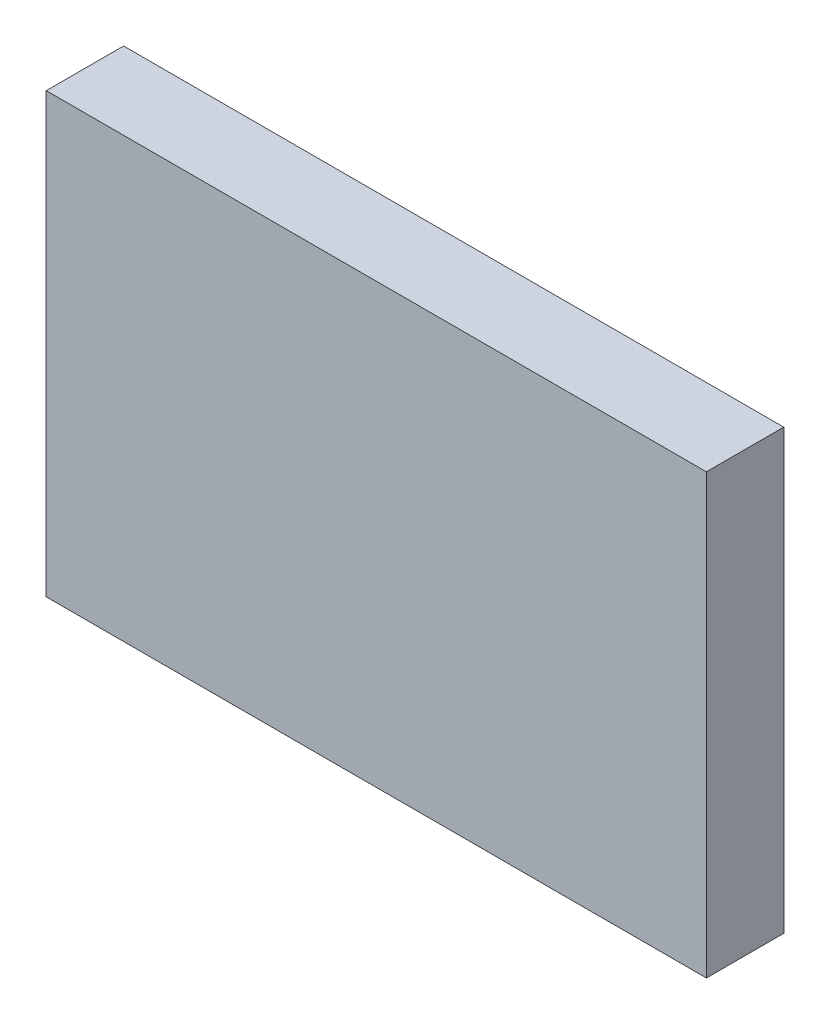
ISO-10303-21;
HEADER;
FILE_DESCRIPTION(('STEP AP214'),'2;1');
FILE_NAME('part.step','',(''),(''),'','','');
FILE_SCHEMA(('AUTOMOTIVE_DESIGN { 1 0 10303 214 1 1 1 1 }'));
ENDSEC;
DATA;
#1=APPLICATION_CONTEXT('core data for automotive mechanical design processes');
#2=APPLICATION_PROTOCOL_DEFINITION('international standard','automotive_design',2000,#1);
#3=PRODUCT_CONTEXT('',#1,'mechanical');
#4=PRODUCT('Part','Part','',(#3));
#5=PRODUCT_RELATED_PRODUCT_CATEGORY('part','',(#4));
#6=PRODUCT_DEFINITION_FORMATION('','',#4);
#7=PRODUCT_DEFINITION_CONTEXT('part definition',#1,'design');
#8=PRODUCT_DEFINITION('design','',#6,#7);
#9=PRODUCT_DEFINITION_SHAPE('','',#8);
#10=(LENGTH_UNIT() NAMED_UNIT(*) SI_UNIT(.MILLI.,.METRE.));
#11=(NAMED_UNIT(*) PLANE_ANGLE_UNIT() SI_UNIT($,.RADIAN.));
#12=(NAMED_UNIT(*) SI_UNIT($,.STERADIAN.) SOLID_ANGLE_UNIT());
#13=UNCERTAINTY_MEASURE_WITH_UNIT(LENGTH_MEASURE(1.E-05),#10,'distance_accuracy_value','');
#14=(GEOMETRIC_REPRESENTATION_CONTEXT(3) GLOBAL_UNCERTAINTY_ASSIGNED_CONTEXT((#13)) GLOBAL_UNIT_ASSIGNED_CONTEXT((#10,
#11,#12)) REPRESENTATION_CONTEXT('',''));
#15=CARTESIAN_POINT('',(0.,0.,0.));
#16=DIRECTION('',(0.,0.,1.));
#17=DIRECTION('',(1.,0.,0.));
#18=AXIS2_PLACEMENT_3D('',#15,#16,#17);
#19=CARTESIAN_POINT('',(0.,0.,19.05));
#20=DIRECTION('',(-1.,0.,0.));
#21=DIRECTION('',(0.,-1.,0.));
#22=AXIS2_PLACEMENT_3D('',#19,#20,#21);
#23=PLANE('',#22);
#24=DIRECTION('',(0.,1.,0.));
#25=VECTOR('',#24,1.);
#26=CARTESIAN_POINT('',(0.,0.,0.));
#27=LINE('',#26,#25);
#28=CARTESIAN_POINT('',(0.,0.,0.));
#29=VERTEX_POINT('',#28);
#30=CARTESIAN_POINT('',(0.,107.95,0.));
#31=VERTEX_POINT('',#30);
#32=EDGE_CURVE('E107',#29,#31,#27,.T.);
#33=ORIENTED_EDGE('',*,*,#32,.T.);
#34=DIRECTION('',(0.,0.,-1.));
#35=VECTOR('',#34,1.);
#36=CARTESIAN_POINT('',(0.,107.95,19.05));
#37=LINE('',#36,#35);
#38=CARTESIAN_POINT('',(0.,107.95,19.05));
#39=VERTEX_POINT('',#38);
#40=EDGE_CURVE('E11',#39,#31,#37,.T.);
#41=ORIENTED_EDGE('',*,*,#40,.F.);
#42=DIRECTION('',(0.,1.,0.));
#43=VECTOR('',#42,1.);
#44=CARTESIAN_POINT('',(0.,0.,19.05));
#45=LINE('',#44,#43);
#46=CARTESIAN_POINT('',(0.,0.,19.05));
#47=VERTEX_POINT('',#46);
#48=EDGE_CURVE('E91',#47,#39,#45,.T.);
#49=ORIENTED_EDGE('',*,*,#48,.F.);
#50=DIRECTION('',(0.,0.,-1.));
#51=VECTOR('',#50,1.);
#52=CARTESIAN_POINT('',(0.,0.,19.05));
#53=LINE('',#52,#51);
#54=EDGE_CURVE('E103',#47,#29,#53,.T.);
#55=ORIENTED_EDGE('',*,*,#54,.T.);
#56=EDGE_LOOP('',(#33,#41,#49,#55));
#57=FACE_BOUND('',#56,.T.);
#58=ADVANCED_FACE('F39',(#57),#23,.F.);
#59=CARTESIAN_POINT('',(0.,107.95,19.05));
#60=DIRECTION('',(0.,-1.,0.));
#61=DIRECTION('',(1.,0.,0.));
#62=AXIS2_PLACEMENT_3D('',#59,#60,#61);
#63=PLANE('',#62);
#64=DIRECTION('',(-1.,0.,0.));
#65=VECTOR('',#64,1.);
#66=CARTESIAN_POINT('',(0.,107.95,0.));
#67=LINE('',#66,#65);
#68=CARTESIAN_POINT('',(-162.56,107.95,0.));
#69=VERTEX_POINT('',#68);
#70=EDGE_CURVE('E96',#31,#69,#67,.T.);
#71=ORIENTED_EDGE('',*,*,#70,.T.);
#72=DIRECTION('',(0.,0.,-1.));
#73=VECTOR('',#72,1.);
#74=CARTESIAN_POINT('',(-162.56,107.95,19.05));
#75=LINE('',#74,#73);
#76=CARTESIAN_POINT('',(-162.56,107.95,19.05));
#77=VERTEX_POINT('',#76);
#78=EDGE_CURVE('E48',#77,#69,#75,.T.);
#79=ORIENTED_EDGE('',*,*,#78,.F.);
#80=DIRECTION('',(-1.,0.,0.));
#81=VECTOR('',#80,1.);
#82=CARTESIAN_POINT('',(0.,107.95,19.05));
#83=LINE('',#82,#81);
#84=EDGE_CURVE('E86',#39,#77,#83,.T.);
#85=ORIENTED_EDGE('',*,*,#84,.F.);
#86=ORIENTED_EDGE('',*,*,#40,.T.);
#87=EDGE_LOOP('',(#71,#79,#85,#86));
#88=FACE_BOUND('',#87,.T.);
#89=ADVANCED_FACE('F95',(#88),#63,.F.);
#90=CARTESIAN_POINT('',(-162.56,0.,19.05));
#91=DIRECTION('',(1.,0.,0.));
#92=DIRECTION('',(0.,0.,-1.));
#93=AXIS2_PLACEMENT_3D('',#90,#91,#92);
#94=PLANE('',#93);
#95=DIRECTION('',(0.,-1.,0.));
#96=VECTOR('',#95,1.);
#97=CARTESIAN_POINT('',(-162.56,0.,0.));
#98=LINE('',#97,#96);
#99=CARTESIAN_POINT('',(-162.56,0.,0.));
#100=VERTEX_POINT('',#99);
#101=EDGE_CURVE('E73',#69,#100,#98,.T.);
#102=ORIENTED_EDGE('',*,*,#101,.T.);
#103=DIRECTION('',(0.,0.,-1.));
#104=VECTOR('',#103,1.);
#105=CARTESIAN_POINT('',(-162.56,0.,19.05));
#106=LINE('',#105,#104);
#107=CARTESIAN_POINT('',(-162.56,0.,19.05));
#108=VERTEX_POINT('',#107);
#109=EDGE_CURVE('E98',#108,#100,#106,.T.);
#110=ORIENTED_EDGE('',*,*,#109,.F.);
#111=DIRECTION('',(0.,-1.,0.));
#112=VECTOR('',#111,1.);
#113=CARTESIAN_POINT('',(-162.56,0.,19.05));
#114=LINE('',#113,#112);
#115=EDGE_CURVE('E89',#77,#108,#114,.T.);
#116=ORIENTED_EDGE('',*,*,#115,.F.);
#117=ORIENTED_EDGE('',*,*,#78,.T.);
#118=EDGE_LOOP('',(#102,#110,#116,#117));
#119=FACE_BOUND('',#118,.T.);
#120=ADVANCED_FACE('F99',(#119),#94,.F.);
#121=CARTESIAN_POINT('',(0.,0.,19.05));
#122=DIRECTION('',(0.,1.,0.));
#123=DIRECTION('',(0.,0.,1.));
#124=AXIS2_PLACEMENT_3D('',#121,#122,#123);
#125=PLANE('',#124);
#126=DIRECTION('',(1.,0.,0.));
#127=VECTOR('',#126,1.);
#128=CARTESIAN_POINT('',(0.,0.,0.));
#129=LINE('',#128,#127);
#130=EDGE_CURVE('E79',#100,#29,#129,.T.);
#131=ORIENTED_EDGE('',*,*,#130,.T.);
#132=ORIENTED_EDGE('',*,*,#54,.F.);
#133=DIRECTION('',(1.,0.,0.));
#134=VECTOR('',#133,1.);
#135=CARTESIAN_POINT('',(0.,0.,19.05));
#136=LINE('',#135,#134);
#137=EDGE_CURVE('E56',#108,#47,#136,.T.);
#138=ORIENTED_EDGE('',*,*,#137,.F.);
#139=ORIENTED_EDGE('',*,*,#109,.T.);
#140=EDGE_LOOP('',(#131,#132,#138,#139));
#141=FACE_BOUND('',#140,.T.);
#142=ADVANCED_FACE('F120',(#141),#125,.F.);
#143=CARTESIAN_POINT('',(0.,0.,19.05));
#144=DIRECTION('',(0.,0.,1.));
#145=DIRECTION('',(1.,0.,0.));
#146=AXIS2_PLACEMENT_3D('',#143,#144,#145);
#147=PLANE('',#146);
#148=ORIENTED_EDGE('',*,*,#48,.T.);
#149=ORIENTED_EDGE('',*,*,#84,.T.);
#150=ORIENTED_EDGE('',*,*,#115,.T.);
#151=ORIENTED_EDGE('',*,*,#137,.T.);
#152=EDGE_LOOP('',(#148,#149,#150,#151));
#153=FACE_BOUND('',#152,.T.);
#154=ADVANCED_FACE('F87',(#153),#147,.T.);
#155=CARTESIAN_POINT('',(0.,0.,0.));
#156=DIRECTION('',(0.,0.,1.));
#157=DIRECTION('',(1.,0.,0.));
#158=AXIS2_PLACEMENT_3D('',#155,#156,#157);
#159=PLANE('',#158);
#160=ORIENTED_EDGE('',*,*,#32,.F.);
#161=ORIENTED_EDGE('',*,*,#130,.F.);
#162=ORIENTED_EDGE('',*,*,#101,.F.);
#163=ORIENTED_EDGE('',*,*,#70,.F.);
#164=EDGE_LOOP('',(#160,#161,#162,#163));
#165=FACE_BOUND('',#164,.T.);
#166=ADVANCED_FACE('F123',(#165),#159,.F.);
#167=CLOSED_SHELL('',(#58,#89,#120,#142,#154,#166));
#168=MANIFOLD_SOLID_BREP('B2',#167);
#169=ADVANCED_BREP_SHAPE_REPRESENTATION('',(#18,#168),#14);
#170=SHAPE_DEFINITION_REPRESENTATION(#9,#169);
ENDSEC;
END-ISO-10303-21;
